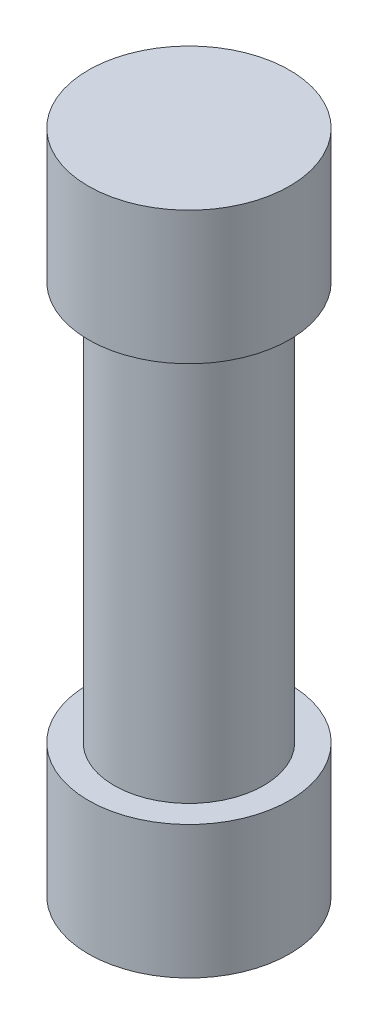
ISO-10303-21;
HEADER;
FILE_DESCRIPTION(('STEP AP214'),'2;1');
FILE_NAME('part.step','',(''),(''),'','','');
FILE_SCHEMA(('AUTOMOTIVE_DESIGN { 1 0 10303 214 1 1 1 1 }'));
ENDSEC;
DATA;
#1=APPLICATION_CONTEXT('core data for automotive mechanical design processes');
#2=APPLICATION_PROTOCOL_DEFINITION('international standard','automotive_design',2000,#1);
#3=PRODUCT_CONTEXT('',#1,'mechanical');
#4=PRODUCT('Part','Part','',(#3));
#5=PRODUCT_RELATED_PRODUCT_CATEGORY('part','',(#4));
#6=PRODUCT_DEFINITION_FORMATION('','',#4);
#7=PRODUCT_DEFINITION_CONTEXT('part definition',#1,'design');
#8=PRODUCT_DEFINITION('design','',#6,#7);
#9=PRODUCT_DEFINITION_SHAPE('','',#8);
#10=(LENGTH_UNIT() NAMED_UNIT(*) SI_UNIT(.MILLI.,.METRE.));
#11=(NAMED_UNIT(*) PLANE_ANGLE_UNIT() SI_UNIT($,.RADIAN.));
#12=(NAMED_UNIT(*) SI_UNIT($,.STERADIAN.) SOLID_ANGLE_UNIT());
#13=UNCERTAINTY_MEASURE_WITH_UNIT(LENGTH_MEASURE(1.E-05),#10,'distance_accuracy_value','');
#14=(GEOMETRIC_REPRESENTATION_CONTEXT(3) GLOBAL_UNCERTAINTY_ASSIGNED_CONTEXT((#13)) GLOBAL_UNIT_ASSIGNED_CONTEXT((#10,
#11,#12)) REPRESENTATION_CONTEXT('',''));
#15=CARTESIAN_POINT('',(0.,0.,0.));
#16=DIRECTION('',(0.,0.,1.));
#17=DIRECTION('',(1.,0.,0.));
#18=AXIS2_PLACEMENT_3D('',#15,#16,#17);
#19=CARTESIAN_POINT('',(0.,4.,0.));
#20=DIRECTION('',(0.,-1.,0.));
#21=DIRECTION('',(0.,0.,-1.));
#22=AXIS2_PLACEMENT_3D('',#19,#20,#21);
#23=CYLINDRICAL_SURFACE('',#22,3.02500000000005);
#24=CARTESIAN_POINT('',(0.,4.,0.));
#25=DIRECTION('',(0.,1.,0.));
#26=DIRECTION('',(0.,0.,1.));
#27=AXIS2_PLACEMENT_3D('',#24,#25,#26);
#28=CIRCLE('',#27,3.02500000000005);
#29=CARTESIAN_POINT('',(0.,4.,3.02500000000005));
#30=VERTEX_POINT('',#29);
#31=EDGE_CURVE('E47',#30,#30,#28,.T.);
#32=ORIENTED_EDGE('',*,*,#31,.F.);
#33=EDGE_LOOP('',(#32));
#34=FACE_BOUND('',#33,.T.);
#35=CARTESIAN_POINT('',(0.,0.,0.));
#36=DIRECTION('',(0.,1.,0.));
#37=DIRECTION('',(0.,0.,1.));
#38=AXIS2_PLACEMENT_3D('',#35,#36,#37);
#39=CIRCLE('',#38,3.02500000000005);
#40=CARTESIAN_POINT('',(0.,0.,3.02500000000005));
#41=VERTEX_POINT('',#40);
#42=EDGE_CURVE('E42',#41,#41,#39,.T.);
#43=ORIENTED_EDGE('',*,*,#42,.T.);
#44=EDGE_LOOP('',(#43));
#45=FACE_BOUND('',#44,.T.);
#46=ADVANCED_FACE('F39',(#34,#45),#23,.T.);
#47=CARTESIAN_POINT('',(0.,4.,0.));
#48=DIRECTION('',(0.,1.,0.));
#49=DIRECTION('',(0.,0.,1.));
#50=AXIS2_PLACEMENT_3D('',#47,#48,#49);
#51=PLANE('',#50);
#52=CARTESIAN_POINT('',(0.,4.,0.));
#53=DIRECTION('',(0.,1.,0.));
#54=DIRECTION('',(0.,0.,1.));
#55=AXIS2_PLACEMENT_3D('',#52,#53,#54);
#56=CIRCLE('',#55,2.25);
#57=CARTESIAN_POINT('',(0.,4.,2.25));
#58=VERTEX_POINT('',#57);
#59=EDGE_CURVE('E10',#58,#58,#56,.T.);
#60=ORIENTED_EDGE('',*,*,#59,.F.);
#61=EDGE_LOOP('',(#60));
#62=FACE_BOUND('',#61,.T.);
#63=ORIENTED_EDGE('',*,*,#31,.T.);
#64=EDGE_LOOP('',(#63));
#65=FACE_BOUND('',#64,.T.);
#66=ADVANCED_FACE('F85',(#62,#65),#51,.T.);
#67=CARTESIAN_POINT('',(0.,0.,0.));
#68=DIRECTION('',(0.,1.,0.));
#69=DIRECTION('',(0.,0.,1.));
#70=AXIS2_PLACEMENT_3D('',#67,#68,#69);
#71=PLANE('',#70);
#72=ORIENTED_EDGE('',*,*,#42,.F.);
#73=EDGE_LOOP('',(#72));
#74=FACE_BOUND('',#73,.T.);
#75=ADVANCED_FACE('F90',(#74),#71,.F.);
#76=CARTESIAN_POINT('',(0.,16.,0.));
#77=DIRECTION('',(0.,-1.,0.));
#78=DIRECTION('',(0.,0.,-1.));
#79=AXIS2_PLACEMENT_3D('',#76,#77,#78);
#80=CYLINDRICAL_SURFACE('',#79,2.25);
#81=CARTESIAN_POINT('',(0.,16.,0.));
#82=DIRECTION('',(0.,1.,0.));
#83=DIRECTION('',(0.,0.,1.));
#84=AXIS2_PLACEMENT_3D('',#81,#82,#83);
#85=CIRCLE('',#84,2.25);
#86=CARTESIAN_POINT('',(0.,16.,2.25));
#87=VERTEX_POINT('',#86);
#88=EDGE_CURVE('E54',#87,#87,#85,.T.);
#89=ORIENTED_EDGE('',*,*,#88,.F.);
#90=EDGE_LOOP('',(#89));
#91=FACE_BOUND('',#90,.T.);
#92=ORIENTED_EDGE('',*,*,#59,.T.);
#93=EDGE_LOOP('',(#92));
#94=FACE_BOUND('',#93,.T.);
#95=ADVANCED_FACE('F72',(#91,#94),#80,.T.);
#96=CARTESIAN_POINT('',(0.,20.,0.));
#97=DIRECTION('',(0.,-1.,0.));
#98=DIRECTION('',(0.,0.,-1.));
#99=AXIS2_PLACEMENT_3D('',#96,#97,#98);
#100=CYLINDRICAL_SURFACE('',#99,3.025);
#101=CARTESIAN_POINT('',(0.,20.,0.));
#102=DIRECTION('',(0.,1.,0.));
#103=DIRECTION('',(0.,0.,1.));
#104=AXIS2_PLACEMENT_3D('',#101,#102,#103);
#105=CIRCLE('',#104,3.025);
#106=CARTESIAN_POINT('',(0.,20.,3.025));
#107=VERTEX_POINT('',#106);
#108=EDGE_CURVE('E58',#107,#107,#105,.T.);
#109=ORIENTED_EDGE('',*,*,#108,.F.);
#110=EDGE_LOOP('',(#109));
#111=FACE_BOUND('',#110,.T.);
#112=CARTESIAN_POINT('',(0.,16.,0.));
#113=DIRECTION('',(0.,1.,0.));
#114=DIRECTION('',(0.,0.,1.));
#115=AXIS2_PLACEMENT_3D('',#112,#113,#114);
#116=CIRCLE('',#115,3.025);
#117=CARTESIAN_POINT('',(0.,16.,3.025));
#118=VERTEX_POINT('',#117);
#119=EDGE_CURVE('E59',#118,#118,#116,.T.);
#120=ORIENTED_EDGE('',*,*,#119,.T.);
#121=EDGE_LOOP('',(#120));
#122=FACE_BOUND('',#121,.T.);
#123=ADVANCED_FACE('F69',(#111,#122),#100,.T.);
#124=CARTESIAN_POINT('',(0.,20.,0.));
#125=DIRECTION('',(0.,1.,0.));
#126=DIRECTION('',(0.,0.,1.));
#127=AXIS2_PLACEMENT_3D('',#124,#125,#126);
#128=PLANE('',#127);
#129=ORIENTED_EDGE('',*,*,#108,.T.);
#130=EDGE_LOOP('',(#129));
#131=FACE_BOUND('',#130,.T.);
#132=ADVANCED_FACE('F67',(#131),#128,.T.);
#133=CARTESIAN_POINT('',(0.,16.,0.));
#134=DIRECTION('',(0.,1.,0.));
#135=DIRECTION('',(0.,0.,1.));
#136=AXIS2_PLACEMENT_3D('',#133,#134,#135);
#137=PLANE('',#136);
#138=ORIENTED_EDGE('',*,*,#88,.T.);
#139=EDGE_LOOP('',(#138));
#140=FACE_BOUND('',#139,.T.);
#141=ORIENTED_EDGE('',*,*,#119,.F.);
#142=EDGE_LOOP('',(#141));
#143=FACE_BOUND('',#142,.T.);
#144=ADVANCED_FACE('F76',(#140,#143),#137,.F.);
#145=CLOSED_SHELL('',(#46,#66,#75,#95,#123,#132,#144));
#146=MANIFOLD_SOLID_BREP('B2',#145);
#147=ADVANCED_BREP_SHAPE_REPRESENTATION('',(#18,#146),#14);
#148=SHAPE_DEFINITION_REPRESENTATION(#9,#147);
ENDSEC;
END-ISO-10303-21;
